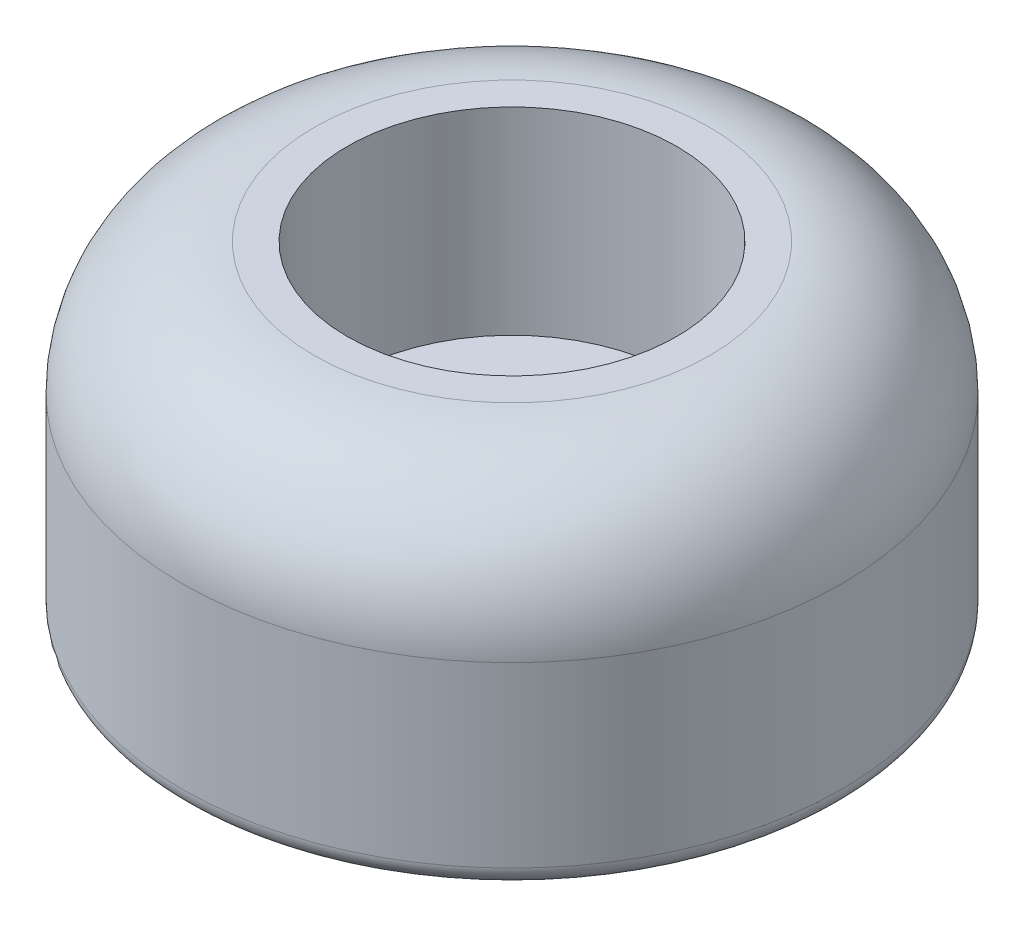
ISO-10303-21;
HEADER;
FILE_DESCRIPTION(('STEP AP214'),'2;1');
FILE_NAME('part.step','',(''),(''),'','','');
FILE_SCHEMA(('AUTOMOTIVE_DESIGN { 1 0 10303 214 1 1 1 1 }'));
ENDSEC;
DATA;
#1=APPLICATION_CONTEXT('core data for automotive mechanical design processes');
#2=APPLICATION_PROTOCOL_DEFINITION('international standard','automotive_design',2000,#1);
#3=PRODUCT_CONTEXT('',#1,'mechanical');
#4=PRODUCT('Part','Part','',(#3));
#5=PRODUCT_RELATED_PRODUCT_CATEGORY('part','',(#4));
#6=PRODUCT_DEFINITION_FORMATION('','',#4);
#7=PRODUCT_DEFINITION_CONTEXT('part definition',#1,'design');
#8=PRODUCT_DEFINITION('design','',#6,#7);
#9=PRODUCT_DEFINITION_SHAPE('','',#8);
#10=(LENGTH_UNIT() NAMED_UNIT(*) SI_UNIT(.MILLI.,.METRE.));
#11=(NAMED_UNIT(*) PLANE_ANGLE_UNIT() SI_UNIT($,.RADIAN.));
#12=(NAMED_UNIT(*) SI_UNIT($,.STERADIAN.) SOLID_ANGLE_UNIT());
#13=UNCERTAINTY_MEASURE_WITH_UNIT(LENGTH_MEASURE(1.E-05),#10,'distance_accuracy_value','');
#14=(GEOMETRIC_REPRESENTATION_CONTEXT(3) GLOBAL_UNCERTAINTY_ASSIGNED_CONTEXT((#13)) GLOBAL_UNIT_ASSIGNED_CONTEXT((#10,
#11,#12)) REPRESENTATION_CONTEXT('',''));
#15=CARTESIAN_POINT('',(0.,0.,0.));
#16=DIRECTION('',(0.,0.,1.));
#17=DIRECTION('',(1.,0.,0.));
#18=AXIS2_PLACEMENT_3D('',#15,#16,#17);
#19=CARTESIAN_POINT('',(2.5,2.,0.));
#20=DIRECTION('',(0.,-1.,0.));
#21=DIRECTION('',(0.,0.,-1.));
#22=AXIS2_PLACEMENT_3D('',#19,#20,#21);
#23=PLANE('',#22);
#24=CARTESIAN_POINT('',(0.,2.,0.));
#25=DIRECTION('',(0.,1.,0.));
#26=DIRECTION('',(0.,0.,1.));
#27=AXIS2_PLACEMENT_3D('',#24,#25,#26);
#28=CIRCLE('',#27,2.5);
#29=CARTESIAN_POINT('',(0.,2.,2.5));
#30=VERTEX_POINT('',#29);
#31=EDGE_CURVE('P0_E58',#30,#30,#28,.T.);
#32=ORIENTED_EDGE('',*,*,#31,.T.);
#33=EDGE_LOOP('',(#32));
#34=FACE_BOUND('',#33,.T.);
#35=CARTESIAN_POINT('',(0.,2.,0.));
#36=DIRECTION('',(0.,1.,0.));
#37=DIRECTION('',(0.,0.,1.));
#38=AXIS2_PLACEMENT_3D('',#35,#36,#37);
#39=CIRCLE('',#38,3.5);
#40=CARTESIAN_POINT('',(0.,2.,3.5));
#41=VERTEX_POINT('',#40);
#42=EDGE_CURVE('P0_E55',#41,#41,#39,.F.);
#43=ORIENTED_EDGE('',*,*,#42,.T.);
#44=EDGE_LOOP('',(#43));
#45=FACE_BOUND('',#44,.T.);
#46=ADVANCED_FACE('P0_F35',(#34,#45),#23,.T.);
#47=CARTESIAN_POINT('',(0.,0.,0.));
#48=DIRECTION('',(0.,1.,0.));
#49=DIRECTION('',(0.,0.,1.));
#50=AXIS2_PLACEMENT_3D('',#47,#48,#49);
#51=CYLINDRICAL_SURFACE('',#50,3.5);
#52=ORIENTED_EDGE('',*,*,#42,.F.);
#53=EDGE_LOOP('',(#52));
#54=FACE_BOUND('',#53,.T.);
#55=CARTESIAN_POINT('',(0.,1.5,0.));
#56=DIRECTION('',(0.,1.,0.));
#57=DIRECTION('',(0.,0.,1.));
#58=AXIS2_PLACEMENT_3D('',#55,#56,#57);
#59=CIRCLE('',#58,3.5);
#60=CARTESIAN_POINT('',(0.,1.5,3.5));
#61=VERTEX_POINT('',#60);
#62=EDGE_CURVE('P0_E63',#61,#61,#59,.T.);
#63=ORIENTED_EDGE('',*,*,#62,.F.);
#64=EDGE_LOOP('',(#63));
#65=FACE_BOUND('',#64,.T.);
#66=ADVANCED_FACE('P0_F129',(#54,#65),#51,.F.);
#67=CARTESIAN_POINT('',(0.,0.,0.));
#68=DIRECTION('',(0.,1.,0.));
#69=DIRECTION('',(0.,0.,1.));
#70=AXIS2_PLACEMENT_3D('',#67,#68,#69);
#71=CYLINDRICAL_SURFACE('',#70,2.5);
#72=CARTESIAN_POINT('',(0.,5.,0.));
#73=DIRECTION('',(0.,1.,0.));
#74=DIRECTION('',(0.,0.,1.));
#75=AXIS2_PLACEMENT_3D('',#72,#73,#74);
#76=CIRCLE('',#75,2.5);
#77=CARTESIAN_POINT('',(0.,5.,2.5));
#78=VERTEX_POINT('',#77);
#79=EDGE_CURVE('P0_E68',#78,#78,#76,.F.);
#80=ORIENTED_EDGE('',*,*,#79,.F.);
#81=EDGE_LOOP('',(#80));
#82=FACE_BOUND('',#81,.T.);
#83=ORIENTED_EDGE('',*,*,#31,.F.);
#84=EDGE_LOOP('',(#83));
#85=FACE_BOUND('',#84,.T.);
#86=ADVANCED_FACE('P0_F125',(#82,#85),#71,.F.);
#87=CARTESIAN_POINT('',(3.5,1.5,0.));
#88=DIRECTION('',(0.,1.,0.));
#89=DIRECTION('',(0.,0.,1.));
#90=AXIS2_PLACEMENT_3D('',#87,#88,#89);
#91=PLANE('',#90);
#92=ORIENTED_EDGE('',*,*,#62,.T.);
#93=EDGE_LOOP('',(#92));
#94=FACE_BOUND('',#93,.T.);
#95=CARTESIAN_POINT('',(0.,1.5,0.));
#96=DIRECTION('',(0.,1.,0.));
#97=DIRECTION('',(0.,0.,1.));
#98=AXIS2_PLACEMENT_3D('',#95,#96,#97);
#99=CIRCLE('',#98,1.5);
#100=CARTESIAN_POINT('',(0.,1.5,1.5));
#101=VERTEX_POINT('',#100);
#102=EDGE_CURVE('P0_E73',#101,#101,#99,.F.);
#103=ORIENTED_EDGE('',*,*,#102,.T.);
#104=EDGE_LOOP('',(#103));
#105=FACE_BOUND('',#104,.T.);
#106=ADVANCED_FACE('P0_F122',(#94,#105),#91,.T.);
#107=CARTESIAN_POINT('',(3.,5.,0.));
#108=DIRECTION('',(0.,1.,0.));
#109=DIRECTION('',(0.,0.,1.));
#110=AXIS2_PLACEMENT_3D('',#107,#108,#109);
#111=PLANE('',#110);
#112=CARTESIAN_POINT('',(0.,5.,0.));
#113=DIRECTION('',(0.,-1.,0.));
#114=DIRECTION('',(0.,0.,-1.));
#115=AXIS2_PLACEMENT_3D('',#112,#113,#114);
#116=CIRCLE('',#115,3.);
#117=CARTESIAN_POINT('',(0.,5.,-3.));
#118=VERTEX_POINT('',#117);
#119=EDGE_CURVE('P0_E78',#118,#118,#116,.T.);
#120=ORIENTED_EDGE('',*,*,#119,.F.);
#121=EDGE_LOOP('',(#120));
#122=FACE_BOUND('',#121,.T.);
#123=ORIENTED_EDGE('',*,*,#79,.T.);
#124=EDGE_LOOP('',(#123));
#125=FACE_BOUND('',#124,.T.);
#126=ADVANCED_FACE('P0_F113',(#122,#125),#111,.T.);
#127=CARTESIAN_POINT('',(0.,0.,0.));
#128=DIRECTION('',(0.,1.,0.));
#129=DIRECTION('',(0.,0.,1.));
#130=AXIS2_PLACEMENT_3D('',#127,#128,#129);
#131=CYLINDRICAL_SURFACE('',#130,1.5);
#132=ORIENTED_EDGE('',*,*,#102,.F.);
#133=EDGE_LOOP('',(#132));
#134=FACE_BOUND('',#133,.T.);
#135=CARTESIAN_POINT('',(0.,0.,0.));
#136=DIRECTION('',(0.,1.,0.));
#137=DIRECTION('',(0.,0.,1.));
#138=AXIS2_PLACEMENT_3D('',#135,#136,#137);
#139=CIRCLE('',#138,1.5);
#140=CARTESIAN_POINT('',(0.,0.,1.5));
#141=VERTEX_POINT('',#140);
#142=EDGE_CURVE('P0_E50',#141,#141,#139,.T.);
#143=ORIENTED_EDGE('',*,*,#142,.F.);
#144=EDGE_LOOP('',(#143));
#145=FACE_BOUND('',#144,.T.);
#146=ADVANCED_FACE('P0_F101',(#134,#145),#131,.F.);
#147=CARTESIAN_POINT('',(0.,3.,0.));
#148=DIRECTION('',(0.,-1.,0.));
#149=DIRECTION('',(0.,0.,-1.));
#150=AXIS2_PLACEMENT_3D('',#147,#148,#149);
#151=TOROIDAL_SURFACE('',#150,3.,2.);
#152=CARTESIAN_POINT('',(0.,3.,0.));
#153=DIRECTION('',(0.,1.,0.));
#154=DIRECTION('',(0.,0.,1.));
#155=AXIS2_PLACEMENT_3D('',#152,#153,#154);
#156=CIRCLE('',#155,5.);
#157=CARTESIAN_POINT('',(0.,3.,5.));
#158=VERTEX_POINT('',#157);
#159=EDGE_CURVE('P0_E46',#158,#158,#156,.F.);
#160=ORIENTED_EDGE('',*,*,#159,.F.);
#161=EDGE_LOOP('',(#160));
#162=FACE_BOUND('',#161,.T.);
#163=ORIENTED_EDGE('',*,*,#119,.T.);
#164=EDGE_LOOP('',(#163));
#165=FACE_BOUND('',#164,.T.);
#166=ADVANCED_FACE('P0_F89',(#162,#165),#151,.T.);
#167=CARTESIAN_POINT('',(1.5,0.,0.));
#168=DIRECTION('',(0.,-1.,0.));
#169=DIRECTION('',(0.,0.,-1.));
#170=AXIS2_PLACEMENT_3D('',#167,#168,#169);
#171=PLANE('',#170);
#172=CARTESIAN_POINT('',(0.,0.,0.));
#173=DIRECTION('',(0.,-1.,0.));
#174=DIRECTION('',(0.,0.,-1.));
#175=AXIS2_PLACEMENT_3D('',#172,#173,#174);
#176=CIRCLE('',#175,4.7);
#177=CARTESIAN_POINT('',(0.,0.,-4.7));
#178=VERTEX_POINT('',#177);
#179=EDGE_CURVE('P0_E10',#178,#178,#176,.T.);
#180=ORIENTED_EDGE('',*,*,#179,.T.);
#181=EDGE_LOOP('',(#180));
#182=FACE_BOUND('',#181,.T.);
#183=ORIENTED_EDGE('',*,*,#142,.T.);
#184=EDGE_LOOP('',(#183));
#185=FACE_BOUND('',#184,.T.);
#186=ADVANCED_FACE('P0_F100',(#182,#185),#171,.T.);
#187=CARTESIAN_POINT('',(0.,0.,0.));
#188=DIRECTION('',(0.,1.,0.));
#189=DIRECTION('',(0.,0.,1.));
#190=AXIS2_PLACEMENT_3D('',#187,#188,#189);
#191=CYLINDRICAL_SURFACE('',#190,5.);
#192=CARTESIAN_POINT('',(0.,0.3,0.));
#193=DIRECTION('',(0.,-1.,0.));
#194=DIRECTION('',(0.,0.,-1.));
#195=AXIS2_PLACEMENT_3D('',#192,#193,#194);
#196=CIRCLE('',#195,5.);
#197=CARTESIAN_POINT('',(0.,0.3,-5.));
#198=VERTEX_POINT('',#197);
#199=EDGE_CURVE('P0_E42',#198,#198,#196,.F.);
#200=ORIENTED_EDGE('',*,*,#199,.T.);
#201=EDGE_LOOP('',(#200));
#202=FACE_BOUND('',#201,.T.);
#203=ORIENTED_EDGE('',*,*,#159,.T.);
#204=EDGE_LOOP('',(#203));
#205=FACE_BOUND('',#204,.T.);
#206=ADVANCED_FACE('P0_F139',(#202,#205),#191,.T.);
#207=CARTESIAN_POINT('',(0.,0.3,0.));
#208=DIRECTION('',(0.,-1.,0.));
#209=DIRECTION('',(0.,0.,-1.));
#210=AXIS2_PLACEMENT_3D('',#207,#208,#209);
#211=TOROIDAL_SURFACE('',#210,4.7,0.3);
#212=ORIENTED_EDGE('',*,*,#179,.F.);
#213=EDGE_LOOP('',(#212));
#214=FACE_BOUND('',#213,.T.);
#215=ORIENTED_EDGE('',*,*,#199,.F.);
#216=EDGE_LOOP('',(#215));
#217=FACE_BOUND('',#216,.T.);
#218=ADVANCED_FACE('P0_F37',(#214,#217),#211,.T.);
#219=CLOSED_SHELL('',(#46,#66,#86,#106,#126,#146,#166,#186,#206,#218));
#220=MANIFOLD_SOLID_BREP('P0_B2',#219);
#221=CARTESIAN_POINT('',(1.5,2.,0.));
#222=DIRECTION('',(0.,1.,0.));
#223=DIRECTION('',(0.,0.,1.));
#224=AXIS2_PLACEMENT_3D('',#221,#222,#223);
#225=PLANE('',#224);
#226=CARTESIAN_POINT('',(0.,2.,0.));
#227=DIRECTION('',(0.,-1.,0.));
#228=DIRECTION('',(0.,0.,-1.));
#229=AXIS2_PLACEMENT_3D('',#226,#227,#228);
#230=CIRCLE('',#229,1.5);
#231=CARTESIAN_POINT('',(0.,2.,-1.5));
#232=VERTEX_POINT('',#231);
#233=EDGE_CURVE('P1_E36',#232,#232,#230,.T.);
#234=ORIENTED_EDGE('',*,*,#233,.T.);
#235=EDGE_LOOP('',(#234));
#236=FACE_BOUND('',#235,.T.);
#237=CARTESIAN_POINT('',(0.,2.,0.));
#238=DIRECTION('',(0.,-1.,0.));
#239=DIRECTION('',(0.,0.,-1.));
#240=AXIS2_PLACEMENT_3D('',#237,#238,#239);
#241=CIRCLE('',#240,3.5);
#242=CARTESIAN_POINT('',(0.,2.,-3.5));
#243=VERTEX_POINT('',#242);
#244=EDGE_CURVE('P1_E27',#243,#243,#241,.T.);
#245=ORIENTED_EDGE('',*,*,#244,.F.);
#246=EDGE_LOOP('',(#245));
#247=FACE_BOUND('',#246,.T.);
#248=ADVANCED_FACE('P1_F15',(#236,#247),#225,.T.);
#249=CARTESIAN_POINT('',(0.,2.,0.));
#250=DIRECTION('',(0.,-1.,0.));
#251=DIRECTION('',(0.,0.,-1.));
#252=AXIS2_PLACEMENT_3D('',#249,#250,#251);
#253=CYLINDRICAL_SURFACE('',#252,1.5);
#254=CARTESIAN_POINT('',(0.,1.5,0.));
#255=DIRECTION('',(0.,-1.,0.));
#256=DIRECTION('',(0.,0.,-1.));
#257=AXIS2_PLACEMENT_3D('',#254,#255,#256);
#258=CIRCLE('',#257,1.5);
#259=CARTESIAN_POINT('',(0.,1.5,-1.5));
#260=VERTEX_POINT('',#259);
#261=EDGE_CURVE('P1_E22',#260,#260,#258,.F.);
#262=ORIENTED_EDGE('',*,*,#261,.F.);
#263=EDGE_LOOP('',(#262));
#264=FACE_BOUND('',#263,.T.);
#265=ORIENTED_EDGE('',*,*,#233,.F.);
#266=EDGE_LOOP('',(#265));
#267=FACE_BOUND('',#266,.T.);
#268=ADVANCED_FACE('P1_F43',(#264,#267),#253,.F.);
#269=CARTESIAN_POINT('',(0.,2.,0.));
#270=DIRECTION('',(0.,-1.,0.));
#271=DIRECTION('',(0.,0.,-1.));
#272=AXIS2_PLACEMENT_3D('',#269,#270,#271);
#273=CYLINDRICAL_SURFACE('',#272,3.5);
#274=ORIENTED_EDGE('',*,*,#244,.T.);
#275=EDGE_LOOP('',(#274));
#276=FACE_BOUND('',#275,.T.);
#277=CARTESIAN_POINT('',(0.,1.5,0.));
#278=DIRECTION('',(0.,-1.,0.));
#279=DIRECTION('',(0.,0.,-1.));
#280=AXIS2_PLACEMENT_3D('',#277,#278,#279);
#281=CIRCLE('',#280,3.5);
#282=CARTESIAN_POINT('',(0.,1.5,-3.5));
#283=VERTEX_POINT('',#282);
#284=EDGE_CURVE('P1_E10',#283,#283,#281,.T.);
#285=ORIENTED_EDGE('',*,*,#284,.F.);
#286=EDGE_LOOP('',(#285));
#287=FACE_BOUND('',#286,.T.);
#288=ADVANCED_FACE('P1_F45',(#276,#287),#273,.T.);
#289=CARTESIAN_POINT('',(3.5,1.5,0.));
#290=DIRECTION('',(0.,-1.,0.));
#291=DIRECTION('',(0.,0.,-1.));
#292=AXIS2_PLACEMENT_3D('',#289,#290,#291);
#293=PLANE('',#292);
#294=ORIENTED_EDGE('',*,*,#284,.T.);
#295=EDGE_LOOP('',(#294));
#296=FACE_BOUND('',#295,.T.);
#297=ORIENTED_EDGE('',*,*,#261,.T.);
#298=EDGE_LOOP('',(#297));
#299=FACE_BOUND('',#298,.T.);
#300=ADVANCED_FACE('P1_F52',(#296,#299),#293,.T.);
#301=CLOSED_SHELL('',(#248,#268,#288,#300));
#302=MANIFOLD_SOLID_BREP('P1_B1',#301);
#303=ADVANCED_BREP_SHAPE_REPRESENTATION('',(#18,#220,#302),#14);
#304=SHAPE_DEFINITION_REPRESENTATION(#9,#303);
ENDSEC;
END-ISO-10303-21;
